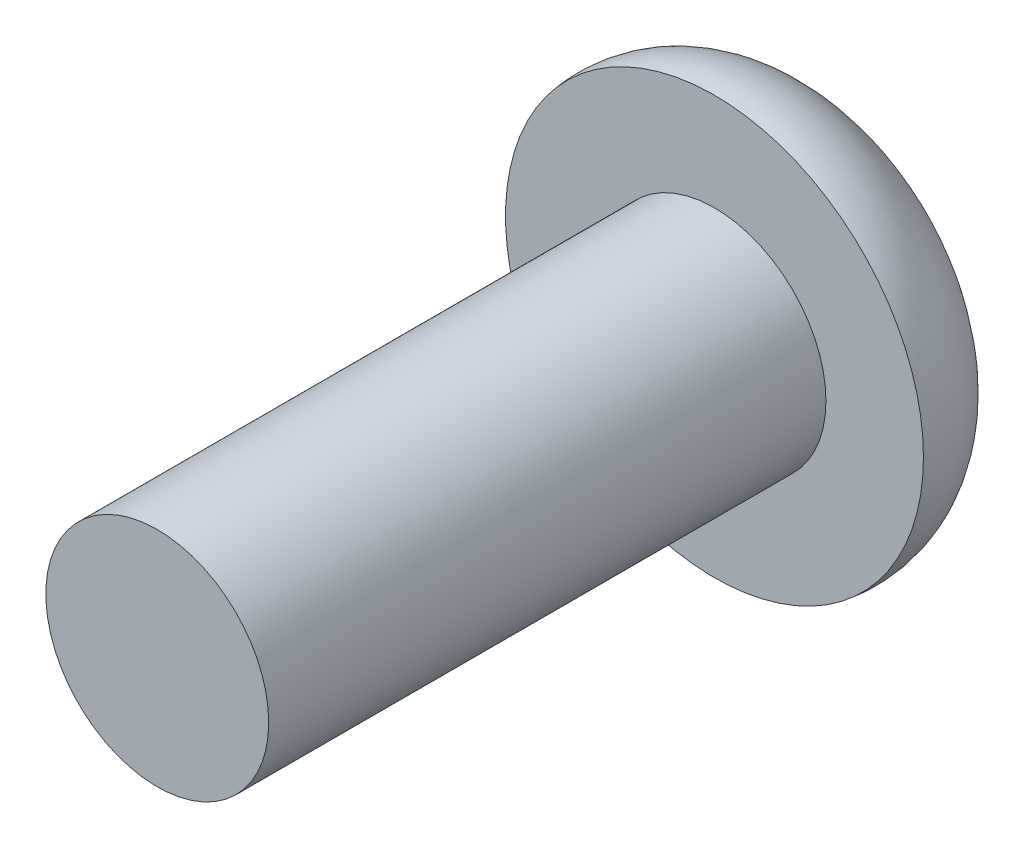
ISO-10303-21;
HEADER;
FILE_DESCRIPTION(('STEP AP214'),'2;1');
FILE_NAME('part.step','',(''),(''),'','','');
FILE_SCHEMA(('AUTOMOTIVE_DESIGN { 1 0 10303 214 1 1 1 1 }'));
ENDSEC;
DATA;
#1=APPLICATION_CONTEXT('core data for automotive mechanical design processes');
#2=APPLICATION_PROTOCOL_DEFINITION('international standard','automotive_design',2000,#1);
#3=PRODUCT_CONTEXT('',#1,'mechanical');
#4=PRODUCT('Part','Part','',(#3));
#5=PRODUCT_RELATED_PRODUCT_CATEGORY('part','',(#4));
#6=PRODUCT_DEFINITION_FORMATION('','',#4);
#7=PRODUCT_DEFINITION_CONTEXT('part definition',#1,'design');
#8=PRODUCT_DEFINITION('design','',#6,#7);
#9=PRODUCT_DEFINITION_SHAPE('','',#8);
#10=(LENGTH_UNIT() NAMED_UNIT(*) SI_UNIT(.MILLI.,.METRE.));
#11=(NAMED_UNIT(*) PLANE_ANGLE_UNIT() SI_UNIT($,.RADIAN.));
#12=(NAMED_UNIT(*) SI_UNIT($,.STERADIAN.) SOLID_ANGLE_UNIT());
#13=UNCERTAINTY_MEASURE_WITH_UNIT(LENGTH_MEASURE(1.E-05),#10,'distance_accuracy_value','');
#14=(GEOMETRIC_REPRESENTATION_CONTEXT(3) GLOBAL_UNCERTAINTY_ASSIGNED_CONTEXT((#13)) GLOBAL_UNIT_ASSIGNED_CONTEXT((#10,
#11,#12)) REPRESENTATION_CONTEXT('',''));
#15=CARTESIAN_POINT('',(0.,0.,0.));
#16=DIRECTION('',(0.,0.,1.));
#17=DIRECTION('',(1.,0.,0.));
#18=AXIS2_PLACEMENT_3D('',#15,#16,#17);
#19=CARTESIAN_POINT('',(0.,0.,0.));
#20=DIRECTION('',(0.,0.,-1.));
#21=DIRECTION('',(-1.,0.,0.));
#22=AXIS2_PLACEMENT_3D('',#19,#20,#21);
#23=PLANE('',#22);
#24=CARTESIAN_POINT('',(0.,0.,0.));
#25=DIRECTION('',(0.,0.,1.));
#26=DIRECTION('',(1.,0.,0.));
#27=AXIS2_PLACEMENT_3D('',#24,#25,#26);
#28=CIRCLE('',#27,2.);
#29=CARTESIAN_POINT('',(2.,0.,0.));
#30=VERTEX_POINT('',#29);
#31=EDGE_CURVE('E11',#30,#30,#28,.T.);
#32=ORIENTED_EDGE('',*,*,#31,.T.);
#33=EDGE_LOOP('',(#32));
#34=FACE_BOUND('',#33,.T.);
#35=ADVANCED_FACE('F32',(#34),#23,.F.);
#36=CARTESIAN_POINT('',(0.,0.,0.));
#37=DIRECTION('',(0.,0.,1.));
#38=DIRECTION('',(1.,0.,0.));
#39=AXIS2_PLACEMENT_3D('',#36,#37,#38);
#40=CYLINDRICAL_SURFACE('',#39,2.);
#41=ORIENTED_EDGE('',*,*,#31,.F.);
#42=EDGE_LOOP('',(#41));
#43=FACE_BOUND('',#42,.T.);
#44=CARTESIAN_POINT('',(0.,0.,-10.));
#45=DIRECTION('',(0.,0.,1.));
#46=DIRECTION('',(1.,0.,0.));
#47=AXIS2_PLACEMENT_3D('',#44,#45,#46);
#48=CIRCLE('',#47,2.);
#49=CARTESIAN_POINT('',(2.,0.,-10.));
#50=VERTEX_POINT('',#49);
#51=EDGE_CURVE('E39',#50,#50,#48,.T.);
#52=ORIENTED_EDGE('',*,*,#51,.T.);
#53=EDGE_LOOP('',(#52));
#54=FACE_BOUND('',#53,.T.);
#55=ADVANCED_FACE('F146',(#43,#54),#40,.T.);
#56=CARTESIAN_POINT('',(-2.,0.,-10.));
#57=DIRECTION('',(0.,0.,-1.));
#58=DIRECTION('',(-1.,0.,0.));
#59=AXIS2_PLACEMENT_3D('',#56,#57,#58);
#60=PLANE('',#59);
#61=ORIENTED_EDGE('',*,*,#51,.F.);
#62=EDGE_LOOP('',(#61));
#63=FACE_BOUND('',#62,.T.);
#64=CARTESIAN_POINT('',(0.,0.,-10.));
#65=DIRECTION('',(0.,0.,1.));
#66=DIRECTION('',(1.,0.,0.));
#67=AXIS2_PLACEMENT_3D('',#64,#65,#66);
#68=CIRCLE('',#67,3.75);
#69=CARTESIAN_POINT('',(3.75,0.,-10.));
#70=VERTEX_POINT('',#69);
#71=EDGE_CURVE('E141',#70,#70,#68,.T.);
#72=ORIENTED_EDGE('',*,*,#71,.T.);
#73=EDGE_LOOP('',(#72));
#74=FACE_BOUND('',#73,.T.);
#75=ADVANCED_FACE('F148',(#63,#74),#60,.F.);
#76=CARTESIAN_POINT('',(0.,0.,-10.234375));
#77=DIRECTION('',(0.,0.,1.));
#78=DIRECTION('',(1.,0.,0.));
#79=AXIS2_PLACEMENT_3D('',#76,#77,#78);
#80=TOROIDAL_SURFACE('',#79,2.,1.765625);
#81=ORIENTED_EDGE('',*,*,#71,.F.);
#82=EDGE_LOOP('',(#81));
#83=FACE_BOUND('',#82,.T.);
#84=CARTESIAN_POINT('',(0.,0.,-12.));
#85=DIRECTION('',(0.,0.,1.));
#86=DIRECTION('',(1.,0.,0.));
#87=AXIS2_PLACEMENT_3D('',#84,#85,#86);
#88=CIRCLE('',#87,2.);
#89=CARTESIAN_POINT('',(2.,0.,-12.));
#90=VERTEX_POINT('',#89);
#91=EDGE_CURVE('E133',#90,#90,#88,.T.);
#92=ORIENTED_EDGE('',*,*,#91,.T.);
#93=EDGE_LOOP('',(#92));
#94=FACE_BOUND('',#93,.T.);
#95=ADVANCED_FACE('F151',(#83,#94),#80,.T.);
#96=CARTESIAN_POINT('',(-2.,0.,-12.));
#97=DIRECTION('',(0.,0.,1.));
#98=DIRECTION('',(1.,0.,0.));
#99=AXIS2_PLACEMENT_3D('',#96,#97,#98);
#100=PLANE('',#99);
#101=DIRECTION('',(-0.866025403784439,0.5,0.));
#102=VECTOR('',#101,1.);
#103=CARTESIAN_POINT('',(0.,-1.44337567297406,-12.));
#104=LINE('',#103,#102);
#105=CARTESIAN_POINT('',(0.,-1.44337567297406,-12.));
#106=VERTEX_POINT('',#105);
#107=CARTESIAN_POINT('',(-1.25,-0.721687836487033,-12.));
#108=VERTEX_POINT('',#107);
#109=EDGE_CURVE('E120',#106,#108,#104,.T.);
#110=ORIENTED_EDGE('',*,*,#109,.F.);
#111=DIRECTION('',(-0.866025403784439,-0.5,0.));
#112=VECTOR('',#111,1.);
#113=CARTESIAN_POINT('',(1.25,-0.721687836487033,-12.));
#114=LINE('',#113,#112);
#115=CARTESIAN_POINT('',(1.25,-0.721687836487033,-12.));
#116=VERTEX_POINT('',#115);
#117=EDGE_CURVE('E46',#116,#106,#114,.T.);
#118=ORIENTED_EDGE('',*,*,#117,.F.);
#119=DIRECTION('',(0.,-1.,0.));
#120=VECTOR('',#119,1.);
#121=CARTESIAN_POINT('',(1.25,0.721687836487033,-12.));
#122=LINE('',#121,#120);
#123=CARTESIAN_POINT('',(1.25,0.721687836487033,-12.));
#124=VERTEX_POINT('',#123);
#125=EDGE_CURVE('E129',#124,#116,#122,.T.);
#126=ORIENTED_EDGE('',*,*,#125,.F.);
#127=DIRECTION('',(0.866025403784439,-0.5,0.));
#128=VECTOR('',#127,1.);
#129=CARTESIAN_POINT('',(0.,1.44337567297407,-12.));
#130=LINE('',#129,#128);
#131=CARTESIAN_POINT('',(0.,1.44337567297407,-12.));
#132=VERTEX_POINT('',#131);
#133=EDGE_CURVE('E127',#132,#124,#130,.T.);
#134=ORIENTED_EDGE('',*,*,#133,.F.);
#135=DIRECTION('',(0.866025403784439,0.5,0.));
#136=VECTOR('',#135,1.);
#137=CARTESIAN_POINT('',(-1.25,0.721687836487034,-12.));
#138=LINE('',#137,#136);
#139=CARTESIAN_POINT('',(-1.25,0.721687836487034,-12.));
#140=VERTEX_POINT('',#139);
#141=EDGE_CURVE('E94',#140,#132,#138,.T.);
#142=ORIENTED_EDGE('',*,*,#141,.F.);
#143=DIRECTION('',(0.,1.,0.));
#144=VECTOR('',#143,1.);
#145=CARTESIAN_POINT('',(-1.25,-0.721687836487033,-12.));
#146=LINE('',#145,#144);
#147=EDGE_CURVE('E123',#108,#140,#146,.T.);
#148=ORIENTED_EDGE('',*,*,#147,.F.);
#149=EDGE_LOOP('',(#110,#118,#126,#134,#142,#148));
#150=FACE_BOUND('',#149,.T.);
#151=ORIENTED_EDGE('',*,*,#91,.F.);
#152=EDGE_LOOP('',(#151));
#153=FACE_BOUND('',#152,.T.);
#154=ADVANCED_FACE('F157',(#150,#153),#100,.F.);
#155=CARTESIAN_POINT('',(1.25,-0.721687836487033,-10.2));
#156=DIRECTION('',(0.5,-0.866025403784439,0.));
#157=DIRECTION('',(0.866025403784439,0.5,0.));
#158=AXIS2_PLACEMENT_3D('',#155,#156,#157);
#159=PLANE('',#158);
#160=ORIENTED_EDGE('',*,*,#117,.T.);
#161=DIRECTION('',(0.,0.,-1.));
#162=VECTOR('',#161,1.);
#163=CARTESIAN_POINT('',(0.,-1.44337567297406,-10.2));
#164=LINE('',#163,#162);
#165=CARTESIAN_POINT('',(0.,-1.44337567297406,-10.2));
#166=VERTEX_POINT('',#165);
#167=EDGE_CURVE('E76',#166,#106,#164,.T.);
#168=ORIENTED_EDGE('',*,*,#167,.F.);
#169=DIRECTION('',(-0.866025403784439,-0.5,0.));
#170=VECTOR('',#169,1.);
#171=CARTESIAN_POINT('',(1.25,-0.721687836487033,-10.2));
#172=LINE('',#171,#170);
#173=CARTESIAN_POINT('',(1.25,-0.721687836487033,-10.2));
#174=VERTEX_POINT('',#173);
#175=EDGE_CURVE('E131',#174,#166,#172,.T.);
#176=ORIENTED_EDGE('',*,*,#175,.F.);
#177=DIRECTION('',(0.,0.,-1.));
#178=VECTOR('',#177,1.);
#179=CARTESIAN_POINT('',(1.25,-0.721687836487033,-10.2));
#180=LINE('',#179,#178);
#181=EDGE_CURVE('E54',#174,#116,#180,.T.);
#182=ORIENTED_EDGE('',*,*,#181,.T.);
#183=EDGE_LOOP('',(#160,#168,#176,#182));
#184=FACE_BOUND('',#183,.T.);
#185=ADVANCED_FACE('F162',(#184),#159,.F.);
#186=CARTESIAN_POINT('',(1.25,0.721687836487033,-10.2));
#187=DIRECTION('',(1.,0.,0.));
#188=DIRECTION('',(0.,1.,0.));
#189=AXIS2_PLACEMENT_3D('',#186,#187,#188);
#190=PLANE('',#189);
#191=ORIENTED_EDGE('',*,*,#125,.T.);
#192=ORIENTED_EDGE('',*,*,#181,.F.);
#193=DIRECTION('',(0.,-1.,0.));
#194=VECTOR('',#193,1.);
#195=CARTESIAN_POINT('',(1.25,0.721687836487033,-10.2));
#196=LINE('',#195,#194);
#197=CARTESIAN_POINT('',(1.25,0.721687836487033,-10.2));
#198=VERTEX_POINT('',#197);
#199=EDGE_CURVE('E106',#198,#174,#196,.T.);
#200=ORIENTED_EDGE('',*,*,#199,.F.);
#201=DIRECTION('',(0.,0.,-1.));
#202=VECTOR('',#201,1.);
#203=CARTESIAN_POINT('',(1.25,0.721687836487033,-10.2));
#204=LINE('',#203,#202);
#205=EDGE_CURVE('E98',#198,#124,#204,.T.);
#206=ORIENTED_EDGE('',*,*,#205,.T.);
#207=EDGE_LOOP('',(#191,#192,#200,#206));
#208=FACE_BOUND('',#207,.T.);
#209=ADVANCED_FACE('F168',(#208),#190,.F.);
#210=CARTESIAN_POINT('',(0.,1.44337567297407,-10.2));
#211=DIRECTION('',(0.5,0.866025403784439,0.));
#212=DIRECTION('',(-0.866025403784439,0.5,0.));
#213=AXIS2_PLACEMENT_3D('',#210,#211,#212);
#214=PLANE('',#213);
#215=ORIENTED_EDGE('',*,*,#133,.T.);
#216=ORIENTED_EDGE('',*,*,#205,.F.);
#217=DIRECTION('',(0.866025403784439,-0.5,0.));
#218=VECTOR('',#217,1.);
#219=CARTESIAN_POINT('',(0.,1.44337567297407,-10.2));
#220=LINE('',#219,#218);
#221=CARTESIAN_POINT('',(0.,1.44337567297407,-10.2));
#222=VERTEX_POINT('',#221);
#223=EDGE_CURVE('E102',#222,#198,#220,.T.);
#224=ORIENTED_EDGE('',*,*,#223,.F.);
#225=DIRECTION('',(0.,0.,-1.));
#226=VECTOR('',#225,1.);
#227=CARTESIAN_POINT('',(0.,1.44337567297407,-10.2));
#228=LINE('',#227,#226);
#229=EDGE_CURVE('E87',#222,#132,#228,.T.);
#230=ORIENTED_EDGE('',*,*,#229,.T.);
#231=EDGE_LOOP('',(#215,#216,#224,#230));
#232=FACE_BOUND('',#231,.T.);
#233=ADVANCED_FACE('F103',(#232),#214,.F.);
#234=CARTESIAN_POINT('',(-1.25,0.721687836487034,-10.2));
#235=DIRECTION('',(-0.5,0.866025403784439,0.));
#236=DIRECTION('',(-0.866025403784439,-0.5,0.));
#237=AXIS2_PLACEMENT_3D('',#234,#235,#236);
#238=PLANE('',#237);
#239=ORIENTED_EDGE('',*,*,#141,.T.);
#240=ORIENTED_EDGE('',*,*,#229,.F.);
#241=DIRECTION('',(0.866025403784439,0.5,0.));
#242=VECTOR('',#241,1.);
#243=CARTESIAN_POINT('',(-1.25,0.721687836487034,-10.2));
#244=LINE('',#243,#242);
#245=CARTESIAN_POINT('',(-1.25,0.721687836487034,-10.2));
#246=VERTEX_POINT('',#245);
#247=EDGE_CURVE('E91',#246,#222,#244,.T.);
#248=ORIENTED_EDGE('',*,*,#247,.F.);
#249=DIRECTION('',(0.,0.,-1.));
#250=VECTOR('',#249,1.);
#251=CARTESIAN_POINT('',(-1.25,0.721687836487034,-10.2));
#252=LINE('',#251,#250);
#253=EDGE_CURVE('E99',#246,#140,#252,.T.);
#254=ORIENTED_EDGE('',*,*,#253,.T.);
#255=EDGE_LOOP('',(#239,#240,#248,#254));
#256=FACE_BOUND('',#255,.T.);
#257=ADVANCED_FACE('F89',(#256),#238,.F.);
#258=CARTESIAN_POINT('',(-1.25,-0.721687836487033,-10.2));
#259=DIRECTION('',(-1.,0.,0.));
#260=DIRECTION('',(0.,0.,1.));
#261=AXIS2_PLACEMENT_3D('',#258,#259,#260);
#262=PLANE('',#261);
#263=ORIENTED_EDGE('',*,*,#147,.T.);
#264=ORIENTED_EDGE('',*,*,#253,.F.);
#265=DIRECTION('',(0.,1.,0.));
#266=VECTOR('',#265,1.);
#267=CARTESIAN_POINT('',(-1.25,-0.721687836487033,-10.2));
#268=LINE('',#267,#266);
#269=CARTESIAN_POINT('',(-1.25,-0.721687836487033,-10.2));
#270=VERTEX_POINT('',#269);
#271=EDGE_CURVE('E112',#270,#246,#268,.T.);
#272=ORIENTED_EDGE('',*,*,#271,.F.);
#273=DIRECTION('',(0.,0.,-1.));
#274=VECTOR('',#273,1.);
#275=CARTESIAN_POINT('',(-1.25,-0.721687836487033,-10.2));
#276=LINE('',#275,#274);
#277=EDGE_CURVE('E136',#270,#108,#276,.T.);
#278=ORIENTED_EDGE('',*,*,#277,.T.);
#279=EDGE_LOOP('',(#263,#264,#272,#278));
#280=FACE_BOUND('',#279,.T.);
#281=ADVANCED_FACE('F223',(#280),#262,.F.);
#282=CARTESIAN_POINT('',(0.,-1.44337567297406,-10.2));
#283=DIRECTION('',(-0.5,-0.866025403784439,0.));
#284=DIRECTION('',(0.866025403784439,-0.5,0.));
#285=AXIS2_PLACEMENT_3D('',#282,#283,#284);
#286=PLANE('',#285);
#287=ORIENTED_EDGE('',*,*,#109,.T.);
#288=ORIENTED_EDGE('',*,*,#277,.F.);
#289=DIRECTION('',(-0.866025403784439,0.5,0.));
#290=VECTOR('',#289,1.);
#291=CARTESIAN_POINT('',(0.,-1.44337567297406,-10.2));
#292=LINE('',#291,#290);
#293=EDGE_CURVE('E114',#166,#270,#292,.T.);
#294=ORIENTED_EDGE('',*,*,#293,.F.);
#295=ORIENTED_EDGE('',*,*,#167,.T.);
#296=EDGE_LOOP('',(#287,#288,#294,#295));
#297=FACE_BOUND('',#296,.T.);
#298=ADVANCED_FACE('F232',(#297),#286,.F.);
#299=CARTESIAN_POINT('',(0.,0.,-10.2));
#300=DIRECTION('',(0.,0.,-1.));
#301=DIRECTION('',(-1.,0.,0.));
#302=AXIS2_PLACEMENT_3D('',#299,#300,#301);
#303=PLANE('',#302);
#304=ORIENTED_EDGE('',*,*,#175,.T.);
#305=ORIENTED_EDGE('',*,*,#293,.T.);
#306=ORIENTED_EDGE('',*,*,#271,.T.);
#307=ORIENTED_EDGE('',*,*,#247,.T.);
#308=ORIENTED_EDGE('',*,*,#223,.T.);
#309=ORIENTED_EDGE('',*,*,#199,.T.);
#310=EDGE_LOOP('',(#304,#305,#306,#307,#308,#309));
#311=FACE_BOUND('',#310,.T.);
#312=ADVANCED_FACE('F109',(#311),#303,.T.);
#313=CLOSED_SHELL('',(#35,#55,#75,#95,#154,#185,#209,#233,#257,#281,#298,#312));
#314=MANIFOLD_SOLID_BREP('B2',#313);
#315=ADVANCED_BREP_SHAPE_REPRESENTATION('',(#18,#314),#14);
#316=SHAPE_DEFINITION_REPRESENTATION(#9,#315);
ENDSEC;
END-ISO-10303-21;
